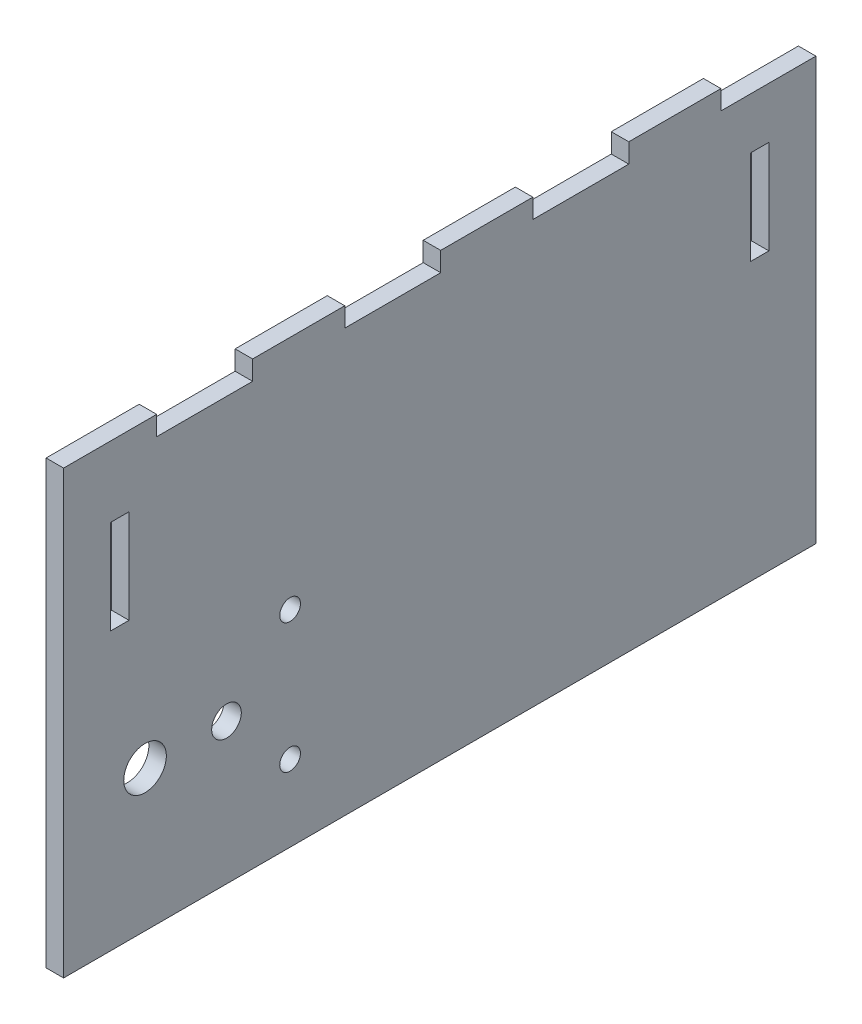
ISO-10303-21;
HEADER;
FILE_DESCRIPTION(('STEP AP214'),'2;1');
FILE_NAME('part.step','',(''),(''),'','','');
FILE_SCHEMA(('AUTOMOTIVE_DESIGN { 1 0 10303 214 1 1 1 1 }'));
ENDSEC;
DATA;
#1=APPLICATION_CONTEXT('core data for automotive mechanical design processes');
#2=APPLICATION_PROTOCOL_DEFINITION('international standard','automotive_design',2000,#1);
#3=PRODUCT_CONTEXT('',#1,'mechanical');
#4=PRODUCT('Part','Part','',(#3));
#5=PRODUCT_RELATED_PRODUCT_CATEGORY('part','',(#4));
#6=PRODUCT_DEFINITION_FORMATION('','',#4);
#7=PRODUCT_DEFINITION_CONTEXT('part definition',#1,'design');
#8=PRODUCT_DEFINITION('design','',#6,#7);
#9=PRODUCT_DEFINITION_SHAPE('','',#8);
#10=(LENGTH_UNIT() NAMED_UNIT(*) SI_UNIT(.MILLI.,.METRE.));
#11=(NAMED_UNIT(*) PLANE_ANGLE_UNIT() SI_UNIT($,.RADIAN.));
#12=(NAMED_UNIT(*) SI_UNIT($,.STERADIAN.) SOLID_ANGLE_UNIT());
#13=UNCERTAINTY_MEASURE_WITH_UNIT(LENGTH_MEASURE(1.E-05),#10,'distance_accuracy_value','');
#14=(GEOMETRIC_REPRESENTATION_CONTEXT(3) GLOBAL_UNCERTAINTY_ASSIGNED_CONTEXT((#13)) GLOBAL_UNIT_ASSIGNED_CONTEXT((#10,
#11,#12)) REPRESENTATION_CONTEXT('',''));
#15=CARTESIAN_POINT('',(0.,0.,0.));
#16=DIRECTION('',(0.,0.,1.));
#17=DIRECTION('',(1.,0.,0.));
#18=AXIS2_PLACEMENT_3D('',#15,#16,#17);
#19=CARTESIAN_POINT('',(2.3622,0.,-101.6));
#20=DIRECTION('',(0.,1.,0.));
#21=DIRECTION('',(0.,0.,1.));
#22=AXIS2_PLACEMENT_3D('',#19,#20,#21);
#23=PLANE('',#22);
#24=DIRECTION('',(0.,0.,-1.));
#25=VECTOR('',#24,1.);
#26=CARTESIAN_POINT('',(0.,0.,-101.6));
#27=LINE('',#26,#25);
#28=CARTESIAN_POINT('',(0.,0.,0.));
#29=VERTEX_POINT('',#28);
#30=CARTESIAN_POINT('',(0.,0.,-101.6));
#31=VERTEX_POINT('',#30);
#32=EDGE_CURVE('E394',#29,#31,#27,.T.);
#33=ORIENTED_EDGE('',*,*,#32,.T.);
#34=DIRECTION('',(-1.,0.,0.));
#35=VECTOR('',#34,1.);
#36=CARTESIAN_POINT('',(2.3622,0.,-101.6));
#37=LINE('',#36,#35);
#38=CARTESIAN_POINT('',(2.3622,0.,-101.6));
#39=VERTEX_POINT('',#38);
#40=EDGE_CURVE('E11',#39,#31,#37,.T.);
#41=ORIENTED_EDGE('',*,*,#40,.F.);
#42=DIRECTION('',(0.,0.,-1.));
#43=VECTOR('',#42,1.);
#44=CARTESIAN_POINT('',(2.3622,0.,-101.6));
#45=LINE('',#44,#43);
#46=CARTESIAN_POINT('',(2.3622,0.,0.));
#47=VERTEX_POINT('',#46);
#48=EDGE_CURVE('E397',#47,#39,#45,.T.);
#49=ORIENTED_EDGE('',*,*,#48,.F.);
#50=DIRECTION('',(-1.,0.,0.));
#51=VECTOR('',#50,1.);
#52=CARTESIAN_POINT('',(2.3622,0.,0.));
#53=LINE('',#52,#51);
#54=EDGE_CURVE('E414',#47,#29,#53,.T.);
#55=ORIENTED_EDGE('',*,*,#54,.T.);
#56=EDGE_LOOP('',(#33,#41,#49,#55));
#57=FACE_BOUND('',#56,.T.);
#58=ADVANCED_FACE('F33',(#57),#23,.F.);
#59=CARTESIAN_POINT('',(2.3622,57.15,-101.6));
#60=DIRECTION('',(0.,0.,1.));
#61=DIRECTION('',(0.,-1.,0.));
#62=AXIS2_PLACEMENT_3D('',#59,#60,#61);
#63=PLANE('',#62);
#64=DIRECTION('',(0.,1.,0.));
#65=VECTOR('',#64,1.);
#66=CARTESIAN_POINT('',(0.,57.15,-101.6));
#67=LINE('',#66,#65);
#68=CARTESIAN_POINT('',(0.,57.023,-101.6));
#69=VERTEX_POINT('',#68);
#70=EDGE_CURVE('E417',#31,#69,#67,.T.);
#71=ORIENTED_EDGE('',*,*,#70,.T.);
#72=DIRECTION('',(1.,0.,0.));
#73=VECTOR('',#72,1.);
#74=CARTESIAN_POINT('',(0.,57.023,-101.6));
#75=LINE('',#74,#73);
#76=CARTESIAN_POINT('',(2.3622,57.023,-101.6));
#77=VERTEX_POINT('',#76);
#78=EDGE_CURVE('E288',#69,#77,#75,.T.);
#79=ORIENTED_EDGE('',*,*,#78,.T.);
#80=DIRECTION('',(0.,1.,0.));
#81=VECTOR('',#80,1.);
#82=CARTESIAN_POINT('',(2.3622,57.15,-101.6));
#83=LINE('',#82,#81);
#84=EDGE_CURVE('E400',#39,#77,#83,.T.);
#85=ORIENTED_EDGE('',*,*,#84,.F.);
#86=ORIENTED_EDGE('',*,*,#40,.T.);
#87=EDGE_LOOP('',(#71,#79,#85,#86));
#88=FACE_BOUND('',#87,.T.);
#89=ADVANCED_FACE('F509',(#88),#63,.F.);
#90=CARTESIAN_POINT('',(2.3622,59.6392,-76.2));
#91=DIRECTION('',(0.,-1.,0.));
#92=DIRECTION('',(0.,0.,-1.));
#93=AXIS2_PLACEMENT_3D('',#90,#91,#92);
#94=PLANE('',#93);
#95=DIRECTION('',(0.,0.,1.));
#96=VECTOR('',#95,1.);
#97=CARTESIAN_POINT('',(2.3622,59.6392,-76.2));
#98=LINE('',#97,#96);
#99=CARTESIAN_POINT('',(2.3622,59.6392,-88.773));
#100=VERTEX_POINT('',#99);
#101=CARTESIAN_POINT('',(2.3622,59.6392,-76.327));
#102=VERTEX_POINT('',#101);
#103=EDGE_CURVE('E404',#100,#102,#98,.T.);
#104=ORIENTED_EDGE('',*,*,#103,.F.);
#105=DIRECTION('',(1.,0.,0.));
#106=VECTOR('',#105,1.);
#107=CARTESIAN_POINT('',(0.,59.6392,-88.773));
#108=LINE('',#107,#106);
#109=CARTESIAN_POINT('',(0.,59.6392,-88.773));
#110=VERTEX_POINT('',#109);
#111=EDGE_CURVE('E285',#110,#100,#108,.T.);
#112=ORIENTED_EDGE('',*,*,#111,.F.);
#113=DIRECTION('',(0.,0.,1.));
#114=VECTOR('',#113,1.);
#115=CARTESIAN_POINT('',(0.,59.6392,-76.2));
#116=LINE('',#115,#114);
#117=CARTESIAN_POINT('',(0.,59.6392,-76.327));
#118=VERTEX_POINT('',#117);
#119=EDGE_CURVE('E420',#110,#118,#116,.T.);
#120=ORIENTED_EDGE('',*,*,#119,.T.);
#121=DIRECTION('',(1.,0.,0.));
#122=VECTOR('',#121,1.);
#123=CARTESIAN_POINT('',(0.,59.6392,-76.327));
#124=LINE('',#123,#122);
#125=EDGE_CURVE('E315',#118,#102,#124,.T.);
#126=ORIENTED_EDGE('',*,*,#125,.T.);
#127=EDGE_LOOP('',(#104,#112,#120,#126));
#128=FACE_BOUND('',#127,.T.);
#129=ADVANCED_FACE('F500',(#128),#94,.F.);
#130=CARTESIAN_POINT('',(2.3622,59.6392,-50.8));
#131=DIRECTION('',(0.,-1.,0.));
#132=DIRECTION('',(0.,0.,-1.));
#133=AXIS2_PLACEMENT_3D('',#130,#131,#132);
#134=PLANE('',#133);
#135=DIRECTION('',(0.,0.,1.));
#136=VECTOR('',#135,1.);
#137=CARTESIAN_POINT('',(2.3622,59.6392,-50.8));
#138=LINE('',#137,#136);
#139=CARTESIAN_POINT('',(2.3622,59.6392,-63.373));
#140=VERTEX_POINT('',#139);
#141=CARTESIAN_POINT('',(2.3622,59.6392,-50.927));
#142=VERTEX_POINT('',#141);
#143=EDGE_CURVE('E406',#140,#142,#138,.T.);
#144=ORIENTED_EDGE('',*,*,#143,.F.);
#145=DIRECTION('',(1.,0.,0.));
#146=VECTOR('',#145,1.);
#147=CARTESIAN_POINT('',(0.,59.6392,-63.373));
#148=LINE('',#147,#146);
#149=CARTESIAN_POINT('',(0.,59.6392,-63.373));
#150=VERTEX_POINT('',#149);
#151=EDGE_CURVE('E313',#150,#140,#148,.T.);
#152=ORIENTED_EDGE('',*,*,#151,.F.);
#153=DIRECTION('',(0.,0.,1.));
#154=VECTOR('',#153,1.);
#155=CARTESIAN_POINT('',(0.,59.6392,-50.8));
#156=LINE('',#155,#154);
#157=CARTESIAN_POINT('',(0.,59.6392,-50.927));
#158=VERTEX_POINT('',#157);
#159=EDGE_CURVE('E422',#150,#158,#156,.T.);
#160=ORIENTED_EDGE('',*,*,#159,.T.);
#161=DIRECTION('',(1.,0.,0.));
#162=VECTOR('',#161,1.);
#163=CARTESIAN_POINT('',(0.,59.6392,-50.927));
#164=LINE('',#163,#162);
#165=EDGE_CURVE('E342',#158,#142,#164,.T.);
#166=ORIENTED_EDGE('',*,*,#165,.T.);
#167=EDGE_LOOP('',(#144,#152,#160,#166));
#168=FACE_BOUND('',#167,.T.);
#169=ADVANCED_FACE('F484',(#168),#134,.F.);
#170=CARTESIAN_POINT('',(2.3622,59.6392,-25.4));
#171=DIRECTION('',(0.,-1.,0.));
#172=DIRECTION('',(0.,0.,-1.));
#173=AXIS2_PLACEMENT_3D('',#170,#171,#172);
#174=PLANE('',#173);
#175=DIRECTION('',(0.,0.,1.));
#176=VECTOR('',#175,1.);
#177=CARTESIAN_POINT('',(2.3622,59.6392,-25.4));
#178=LINE('',#177,#176);
#179=CARTESIAN_POINT('',(2.3622,59.6392,-37.973));
#180=VERTEX_POINT('',#179);
#181=CARTESIAN_POINT('',(2.3622,59.6392,-25.527));
#182=VERTEX_POINT('',#181);
#183=EDGE_CURVE('E408',#180,#182,#178,.T.);
#184=ORIENTED_EDGE('',*,*,#183,.F.);
#185=DIRECTION('',(1.,0.,0.));
#186=VECTOR('',#185,1.);
#187=CARTESIAN_POINT('',(0.,59.6392,-37.973));
#188=LINE('',#187,#186);
#189=CARTESIAN_POINT('',(0.,59.6392,-37.973));
#190=VERTEX_POINT('',#189);
#191=EDGE_CURVE('E340',#190,#180,#188,.T.);
#192=ORIENTED_EDGE('',*,*,#191,.F.);
#193=DIRECTION('',(0.,0.,1.));
#194=VECTOR('',#193,1.);
#195=CARTESIAN_POINT('',(0.,59.6392,-25.4));
#196=LINE('',#195,#194);
#197=CARTESIAN_POINT('',(0.,59.6392,-25.527));
#198=VERTEX_POINT('',#197);
#199=EDGE_CURVE('E424',#190,#198,#196,.T.);
#200=ORIENTED_EDGE('',*,*,#199,.T.);
#201=DIRECTION('',(1.,0.,0.));
#202=VECTOR('',#201,1.);
#203=CARTESIAN_POINT('',(0.,59.6392,-25.527));
#204=LINE('',#203,#202);
#205=EDGE_CURVE('E369',#198,#182,#204,.T.);
#206=ORIENTED_EDGE('',*,*,#205,.T.);
#207=EDGE_LOOP('',(#184,#192,#200,#206));
#208=FACE_BOUND('',#207,.T.);
#209=ADVANCED_FACE('F466',(#208),#174,.F.);
#210=CARTESIAN_POINT('',(2.3622,59.6392,0.));
#211=DIRECTION('',(0.,-1.,0.));
#212=DIRECTION('',(0.,0.,-1.));
#213=AXIS2_PLACEMENT_3D('',#210,#211,#212);
#214=PLANE('',#213);
#215=DIRECTION('',(0.,0.,1.));
#216=VECTOR('',#215,1.);
#217=CARTESIAN_POINT('',(2.3622,59.6392,0.));
#218=LINE('',#217,#216);
#219=CARTESIAN_POINT('',(2.3622,59.6392,-12.573));
#220=VERTEX_POINT('',#219);
#221=CARTESIAN_POINT('',(2.3622,59.6392,0.));
#222=VERTEX_POINT('',#221);
#223=EDGE_CURVE('E410',#220,#222,#218,.T.);
#224=ORIENTED_EDGE('',*,*,#223,.F.);
#225=DIRECTION('',(1.,0.,0.));
#226=VECTOR('',#225,1.);
#227=CARTESIAN_POINT('',(0.,59.6392,-12.573));
#228=LINE('',#227,#226);
#229=CARTESIAN_POINT('',(0.,59.6392,-12.573));
#230=VERTEX_POINT('',#229);
#231=EDGE_CURVE('E367',#230,#220,#228,.T.);
#232=ORIENTED_EDGE('',*,*,#231,.F.);
#233=DIRECTION('',(0.,0.,1.));
#234=VECTOR('',#233,1.);
#235=CARTESIAN_POINT('',(0.,59.6392,0.));
#236=LINE('',#235,#234);
#237=CARTESIAN_POINT('',(0.,59.6392,0.));
#238=VERTEX_POINT('',#237);
#239=EDGE_CURVE('E426',#230,#238,#236,.T.);
#240=ORIENTED_EDGE('',*,*,#239,.T.);
#241=DIRECTION('',(-1.,0.,0.));
#242=VECTOR('',#241,1.);
#243=CARTESIAN_POINT('',(2.3622,59.6392,0.));
#244=LINE('',#243,#242);
#245=EDGE_CURVE('E40',#222,#238,#244,.T.);
#246=ORIENTED_EDGE('',*,*,#245,.F.);
#247=EDGE_LOOP('',(#224,#232,#240,#246));
#248=FACE_BOUND('',#247,.T.);
#249=ADVANCED_FACE('F452',(#248),#214,.F.);
#250=CARTESIAN_POINT('',(2.3622,0.,0.));
#251=DIRECTION('',(0.,0.,-1.));
#252=DIRECTION('',(-1.,0.,0.));
#253=AXIS2_PLACEMENT_3D('',#250,#251,#252);
#254=PLANE('',#253);
#255=DIRECTION('',(0.,-1.,0.));
#256=VECTOR('',#255,1.);
#257=CARTESIAN_POINT('',(0.,0.,0.));
#258=LINE('',#257,#256);
#259=EDGE_CURVE('E401',#238,#29,#258,.T.);
#260=ORIENTED_EDGE('',*,*,#259,.T.);
#261=ORIENTED_EDGE('',*,*,#54,.F.);
#262=DIRECTION('',(0.,-1.,0.));
#263=VECTOR('',#262,1.);
#264=CARTESIAN_POINT('',(2.3622,0.,0.));
#265=LINE('',#264,#263);
#266=EDGE_CURVE('E412',#222,#47,#265,.T.);
#267=ORIENTED_EDGE('',*,*,#266,.F.);
#268=ORIENTED_EDGE('',*,*,#245,.T.);
#269=EDGE_LOOP('',(#260,#261,#267,#268));
#270=FACE_BOUND('',#269,.T.);
#271=ADVANCED_FACE('F435',(#270),#254,.F.);
#272=CARTESIAN_POINT('',(2.3622,0.,0.));
#273=DIRECTION('',(-1.,0.,0.));
#274=DIRECTION('',(0.,0.,1.));
#275=AXIS2_PLACEMENT_3D('',#272,#273,#274);
#276=PLANE('',#275);
#277=DIRECTION('',(0.,-1.,0.));
#278=VECTOR('',#277,1.);
#279=CARTESIAN_POINT('',(2.3622,50.1142,-92.7608));
#280=LINE('',#279,#278);
#281=CARTESIAN_POINT('',(2.3622,50.1142,-92.7608));
#282=VERTEX_POINT('',#281);
#283=CARTESIAN_POINT('',(2.3622,37.4142,-92.7608));
#284=VERTEX_POINT('',#283);
#285=EDGE_CURVE('E232',#282,#284,#280,.T.);
#286=ORIENTED_EDGE('',*,*,#285,.F.);
#287=DIRECTION('',(0.,0.,1.));
#288=VECTOR('',#287,1.);
#289=CARTESIAN_POINT('',(2.3622,50.1142,-95.25));
#290=LINE('',#289,#288);
#291=CARTESIAN_POINT('',(2.3622,50.1142,-95.25));
#292=VERTEX_POINT('',#291);
#293=EDGE_CURVE('E47',#292,#282,#290,.T.);
#294=ORIENTED_EDGE('',*,*,#293,.F.);
#295=DIRECTION('',(0.,1.,0.));
#296=VECTOR('',#295,1.);
#297=CARTESIAN_POINT('',(2.3622,50.1142,-95.25));
#298=LINE('',#297,#296);
#299=CARTESIAN_POINT('',(2.3622,37.4142,-95.25));
#300=VERTEX_POINT('',#299);
#301=EDGE_CURVE('E223',#300,#292,#298,.T.);
#302=ORIENTED_EDGE('',*,*,#301,.F.);
#303=DIRECTION('',(0.,0.,-1.));
#304=VECTOR('',#303,1.);
#305=CARTESIAN_POINT('',(2.3622,37.4142,-95.25));
#306=LINE('',#305,#304);
#307=EDGE_CURVE('E226',#284,#300,#306,.T.);
#308=ORIENTED_EDGE('',*,*,#307,.F.);
#309=EDGE_LOOP('',(#286,#294,#302,#308));
#310=FACE_BOUND('',#309,.T.);
#311=DIRECTION('',(0.,0.,-1.));
#312=VECTOR('',#311,1.);
#313=CARTESIAN_POINT('',(2.3622,37.4142,-6.35));
#314=LINE('',#313,#312);
#315=CARTESIAN_POINT('',(2.3622,37.4142,-6.35));
#316=VERTEX_POINT('',#315);
#317=CARTESIAN_POINT('',(2.3622,37.4142,-8.8392));
#318=VERTEX_POINT('',#317);
#319=EDGE_CURVE('E257',#316,#318,#314,.T.);
#320=ORIENTED_EDGE('',*,*,#319,.F.);
#321=DIRECTION('',(0.,-1.,0.));
#322=VECTOR('',#321,1.);
#323=CARTESIAN_POINT('',(2.3622,50.1142,-6.35));
#324=LINE('',#323,#322);
#325=CARTESIAN_POINT('',(2.3622,50.1142,-6.35));
#326=VERTEX_POINT('',#325);
#327=EDGE_CURVE('E238',#326,#316,#324,.T.);
#328=ORIENTED_EDGE('',*,*,#327,.F.);
#329=DIRECTION('',(0.,0.,1.));
#330=VECTOR('',#329,1.);
#331=CARTESIAN_POINT('',(2.3622,50.1142,-6.35));
#332=LINE('',#331,#330);
#333=CARTESIAN_POINT('',(2.3622,50.1142,-8.8392));
#334=VERTEX_POINT('',#333);
#335=EDGE_CURVE('E246',#334,#326,#332,.T.);
#336=ORIENTED_EDGE('',*,*,#335,.F.);
#337=DIRECTION('',(0.,1.,0.));
#338=VECTOR('',#337,1.);
#339=CARTESIAN_POINT('',(2.3622,50.1142,-8.8392));
#340=LINE('',#339,#338);
#341=EDGE_CURVE('E260',#318,#334,#340,.T.);
#342=ORIENTED_EDGE('',*,*,#341,.F.);
#343=EDGE_LOOP('',(#320,#328,#336,#342));
#344=FACE_BOUND('',#343,.T.);
#345=CARTESIAN_POINT('',(2.3622,19.05,-11.));
#346=DIRECTION('',(1.,0.,0.));
#347=DIRECTION('',(0.,0.,1.));
#348=AXIS2_PLACEMENT_3D('',#345,#346,#347);
#349=CIRCLE('',#348,2.87699996099999);
#350=CARTESIAN_POINT('',(2.3622,19.05,-8.12300003899999));
#351=VERTEX_POINT('',#350);
#352=EDGE_CURVE('E373',#351,#351,#349,.T.);
#353=ORIENTED_EDGE('',*,*,#352,.F.);
#354=EDGE_LOOP('',(#353));
#355=FACE_BOUND('',#354,.T.);
#356=CARTESIAN_POINT('',(2.3622,19.05,-22.0000034));
#357=DIRECTION('',(1.,0.,0.));
#358=DIRECTION('',(0.,0.,1.));
#359=AXIS2_PLACEMENT_3D('',#356,#357,#358);
#360=CIRCLE('',#359,1.99999999999998);
#361=CARTESIAN_POINT('',(2.3622,19.05,-20.0000034));
#362=VERTEX_POINT('',#361);
#363=EDGE_CURVE('E379',#362,#362,#360,.T.);
#364=ORIENTED_EDGE('',*,*,#363,.F.);
#365=EDGE_LOOP('',(#364));
#366=FACE_BOUND('',#365,.T.);
#367=CARTESIAN_POINT('',(2.3622,27.8,-30.59102));
#368=DIRECTION('',(1.,0.,0.));
#369=DIRECTION('',(0.,0.,1.));
#370=AXIS2_PLACEMENT_3D('',#367,#368,#369);
#371=CIRCLE('',#370,1.39999999999999);
#372=CARTESIAN_POINT('',(2.3622,27.8,-29.19102));
#373=VERTEX_POINT('',#372);
#374=EDGE_CURVE('E385',#373,#373,#371,.T.);
#375=ORIENTED_EDGE('',*,*,#374,.F.);
#376=EDGE_LOOP('',(#375));
#377=FACE_BOUND('',#376,.T.);
#378=CARTESIAN_POINT('',(2.3622,10.3,-30.59102));
#379=DIRECTION('',(1.,0.,0.));
#380=DIRECTION('',(0.,0.,1.));
#381=AXIS2_PLACEMENT_3D('',#378,#379,#380);
#382=CIRCLE('',#381,1.39999999999999);
#383=CARTESIAN_POINT('',(2.3622,10.3,-29.19102));
#384=VERTEX_POINT('',#383);
#385=EDGE_CURVE('E391',#384,#384,#382,.T.);
#386=ORIENTED_EDGE('',*,*,#385,.F.);
#387=EDGE_LOOP('',(#386));
#388=FACE_BOUND('',#387,.T.);
#389=DIRECTION('',(0.,0.,-1.));
#390=VECTOR('',#389,1.);
#391=CARTESIAN_POINT('',(2.3622,57.0230000000001,0.));
#392=LINE('',#391,#390);
#393=CARTESIAN_POINT('',(2.3622,57.023,-88.773));
#394=VERTEX_POINT('',#393);
#395=EDGE_CURVE('E278',#394,#77,#392,.T.);
#396=ORIENTED_EDGE('',*,*,#395,.F.);
#397=DIRECTION('',(0.,-1.,0.));
#398=VECTOR('',#397,1.);
#399=CARTESIAN_POINT('',(2.3622,0.,-88.773));
#400=LINE('',#399,#398);
#401=EDGE_CURVE('E267',#100,#394,#400,.T.);
#402=ORIENTED_EDGE('',*,*,#401,.F.);
#403=ORIENTED_EDGE('',*,*,#103,.T.);
#404=DIRECTION('',(0.,1.,0.));
#405=VECTOR('',#404,1.);
#406=CARTESIAN_POINT('',(2.3622,0.,-76.327));
#407=LINE('',#406,#405);
#408=CARTESIAN_POINT('',(2.3622,57.023,-76.327));
#409=VERTEX_POINT('',#408);
#410=EDGE_CURVE('E305',#409,#102,#407,.T.);
#411=ORIENTED_EDGE('',*,*,#410,.F.);
#412=DIRECTION('',(0.,0.,-1.));
#413=VECTOR('',#412,1.);
#414=CARTESIAN_POINT('',(2.3622,57.023,0.));
#415=LINE('',#414,#413);
#416=CARTESIAN_POINT('',(2.3622,57.023,-63.373));
#417=VERTEX_POINT('',#416);
#418=EDGE_CURVE('E287',#417,#409,#415,.T.);
#419=ORIENTED_EDGE('',*,*,#418,.F.);
#420=DIRECTION('',(0.,-1.,0.));
#421=VECTOR('',#420,1.);
#422=CARTESIAN_POINT('',(2.3622,0.,-63.373));
#423=LINE('',#422,#421);
#424=EDGE_CURVE('E296',#140,#417,#423,.T.);
#425=ORIENTED_EDGE('',*,*,#424,.F.);
#426=ORIENTED_EDGE('',*,*,#143,.T.);
#427=DIRECTION('',(0.,1.,0.));
#428=VECTOR('',#427,1.);
#429=CARTESIAN_POINT('',(2.3622,0.,-50.927));
#430=LINE('',#429,#428);
#431=CARTESIAN_POINT('',(2.3622,57.023,-50.927));
#432=VERTEX_POINT('',#431);
#433=EDGE_CURVE('E332',#432,#142,#430,.T.);
#434=ORIENTED_EDGE('',*,*,#433,.F.);
#435=DIRECTION('',(0.,0.,-1.));
#436=VECTOR('',#435,1.);
#437=CARTESIAN_POINT('',(2.3622,57.023,0.));
#438=LINE('',#437,#436);
#439=CARTESIAN_POINT('',(2.3622,57.023,-37.973));
#440=VERTEX_POINT('',#439);
#441=EDGE_CURVE('E312',#440,#432,#438,.T.);
#442=ORIENTED_EDGE('',*,*,#441,.F.);
#443=DIRECTION('',(0.,-1.,0.));
#444=VECTOR('',#443,1.);
#445=CARTESIAN_POINT('',(2.3622,0.,-37.973));
#446=LINE('',#445,#444);
#447=EDGE_CURVE('E323',#180,#440,#446,.T.);
#448=ORIENTED_EDGE('',*,*,#447,.F.);
#449=ORIENTED_EDGE('',*,*,#183,.T.);
#450=DIRECTION('',(0.,1.,0.));
#451=VECTOR('',#450,1.);
#452=CARTESIAN_POINT('',(2.3622,0.,-25.527));
#453=LINE('',#452,#451);
#454=CARTESIAN_POINT('',(2.3622,57.023,-25.527));
#455=VERTEX_POINT('',#454);
#456=EDGE_CURVE('E359',#455,#182,#453,.T.);
#457=ORIENTED_EDGE('',*,*,#456,.F.);
#458=DIRECTION('',(0.,0.,-1.));
#459=VECTOR('',#458,1.);
#460=CARTESIAN_POINT('',(2.3622,57.023,0.));
#461=LINE('',#460,#459);
#462=CARTESIAN_POINT('',(2.3622,57.023,-12.573));
#463=VERTEX_POINT('',#462);
#464=EDGE_CURVE('E339',#463,#455,#461,.T.);
#465=ORIENTED_EDGE('',*,*,#464,.F.);
#466=DIRECTION('',(0.,-1.,0.));
#467=VECTOR('',#466,1.);
#468=CARTESIAN_POINT('',(2.3622,0.,-12.573));
#469=LINE('',#468,#467);
#470=EDGE_CURVE('E350',#220,#463,#469,.T.);
#471=ORIENTED_EDGE('',*,*,#470,.F.);
#472=ORIENTED_EDGE('',*,*,#223,.T.);
#473=ORIENTED_EDGE('',*,*,#266,.T.);
#474=ORIENTED_EDGE('',*,*,#48,.T.);
#475=ORIENTED_EDGE('',*,*,#84,.T.);
#476=EDGE_LOOP('',(#396,#402,#403,#411,#419,#425,#426,#434,#442,#448,#449,#457,#465,#471,#472,
#473,#474,#475));
#477=FACE_BOUND('',#476,.T.);
#478=ADVANCED_FACE('F448',(#310,#344,#355,#366,#377,#388,#477),#276,.F.);
#479=CARTESIAN_POINT('',(0.,0.,0.));
#480=DIRECTION('',(-1.,0.,0.));
#481=DIRECTION('',(0.,0.,1.));
#482=AXIS2_PLACEMENT_3D('',#479,#480,#481);
#483=PLANE('',#482);
#484=DIRECTION('',(0.,0.,1.));
#485=VECTOR('',#484,1.);
#486=CARTESIAN_POINT('',(0.,50.1142,-95.25));
#487=LINE('',#486,#485);
#488=CARTESIAN_POINT('',(0.,50.1142,-95.25));
#489=VERTEX_POINT('',#488);
#490=CARTESIAN_POINT('',(0.,50.1142,-92.7608));
#491=VERTEX_POINT('',#490);
#492=EDGE_CURVE('E207',#489,#491,#487,.T.);
#493=ORIENTED_EDGE('',*,*,#492,.T.);
#494=DIRECTION('',(0.,-1.,0.));
#495=VECTOR('',#494,1.);
#496=CARTESIAN_POINT('',(0.,50.1142,-92.7608));
#497=LINE('',#496,#495);
#498=CARTESIAN_POINT('',(0.,37.4142,-92.7608));
#499=VERTEX_POINT('',#498);
#500=EDGE_CURVE('E216',#491,#499,#497,.T.);
#501=ORIENTED_EDGE('',*,*,#500,.T.);
#502=DIRECTION('',(0.,0.,-1.));
#503=VECTOR('',#502,1.);
#504=CARTESIAN_POINT('',(0.,37.4142,-95.25));
#505=LINE('',#504,#503);
#506=CARTESIAN_POINT('',(0.,37.4142,-95.25));
#507=VERTEX_POINT('',#506);
#508=EDGE_CURVE('E55',#499,#507,#505,.T.);
#509=ORIENTED_EDGE('',*,*,#508,.T.);
#510=DIRECTION('',(0.,1.,0.));
#511=VECTOR('',#510,1.);
#512=CARTESIAN_POINT('',(0.,50.1142,-95.25));
#513=LINE('',#512,#511);
#514=EDGE_CURVE('E213',#507,#489,#513,.T.);
#515=ORIENTED_EDGE('',*,*,#514,.T.);
#516=EDGE_LOOP('',(#493,#501,#509,#515));
#517=FACE_BOUND('',#516,.T.);
#518=DIRECTION('',(0.,-1.,0.));
#519=VECTOR('',#518,1.);
#520=CARTESIAN_POINT('',(0.,50.1142,-6.35));
#521=LINE('',#520,#519);
#522=CARTESIAN_POINT('',(0.,50.1142,-6.35));
#523=VERTEX_POINT('',#522);
#524=CARTESIAN_POINT('',(0.,37.4142,-6.35));
#525=VERTEX_POINT('',#524);
#526=EDGE_CURVE('E242',#523,#525,#521,.T.);
#527=ORIENTED_EDGE('',*,*,#526,.T.);
#528=DIRECTION('',(0.,0.,-1.));
#529=VECTOR('',#528,1.);
#530=CARTESIAN_POINT('',(0.,37.4142,-6.35));
#531=LINE('',#530,#529);
#532=CARTESIAN_POINT('',(0.,37.4142,-8.8392));
#533=VERTEX_POINT('',#532);
#534=EDGE_CURVE('E245',#525,#533,#531,.T.);
#535=ORIENTED_EDGE('',*,*,#534,.T.);
#536=DIRECTION('',(0.,1.,0.));
#537=VECTOR('',#536,1.);
#538=CARTESIAN_POINT('',(0.,50.1142,-8.8392));
#539=LINE('',#538,#537);
#540=CARTESIAN_POINT('',(0.,50.1142,-8.8392));
#541=VERTEX_POINT('',#540);
#542=EDGE_CURVE('E249',#533,#541,#539,.T.);
#543=ORIENTED_EDGE('',*,*,#542,.T.);
#544=DIRECTION('',(0.,0.,1.));
#545=VECTOR('',#544,1.);
#546=CARTESIAN_POINT('',(0.,50.1142,-6.35));
#547=LINE('',#546,#545);
#548=EDGE_CURVE('E252',#541,#523,#547,.T.);
#549=ORIENTED_EDGE('',*,*,#548,.T.);
#550=EDGE_LOOP('',(#527,#535,#543,#549));
#551=FACE_BOUND('',#550,.T.);
#552=DIRECTION('',(0.,-1.,0.));
#553=VECTOR('',#552,1.);
#554=CARTESIAN_POINT('',(0.,0.,-88.773));
#555=LINE('',#554,#553);
#556=CARTESIAN_POINT('',(0.,57.023,-88.773));
#557=VERTEX_POINT('',#556);
#558=EDGE_CURVE('E274',#110,#557,#555,.T.);
#559=ORIENTED_EDGE('',*,*,#558,.T.);
#560=DIRECTION('',(0.,0.,-1.));
#561=VECTOR('',#560,1.);
#562=CARTESIAN_POINT('',(0.,57.0230000000001,0.));
#563=LINE('',#562,#561);
#564=EDGE_CURVE('E277',#557,#69,#563,.T.);
#565=ORIENTED_EDGE('',*,*,#564,.T.);
#566=ORIENTED_EDGE('',*,*,#70,.F.);
#567=ORIENTED_EDGE('',*,*,#32,.F.);
#568=ORIENTED_EDGE('',*,*,#259,.F.);
#569=ORIENTED_EDGE('',*,*,#239,.F.);
#570=DIRECTION('',(0.,-1.,0.));
#571=VECTOR('',#570,1.);
#572=CARTESIAN_POINT('',(0.,0.,-12.573));
#573=LINE('',#572,#571);
#574=CARTESIAN_POINT('',(0.,57.023,-12.573));
#575=VERTEX_POINT('',#574);
#576=EDGE_CURVE('E353',#230,#575,#573,.T.);
#577=ORIENTED_EDGE('',*,*,#576,.T.);
#578=DIRECTION('',(0.,0.,-1.));
#579=VECTOR('',#578,1.);
#580=CARTESIAN_POINT('',(0.,57.023,0.));
#581=LINE('',#580,#579);
#582=CARTESIAN_POINT('',(0.,57.023,-25.527));
#583=VERTEX_POINT('',#582);
#584=EDGE_CURVE('E346',#575,#583,#581,.T.);
#585=ORIENTED_EDGE('',*,*,#584,.T.);
#586=DIRECTION('',(0.,1.,0.));
#587=VECTOR('',#586,1.);
#588=CARTESIAN_POINT('',(0.,0.,-25.527));
#589=LINE('',#588,#587);
#590=EDGE_CURVE('E349',#583,#198,#589,.T.);
#591=ORIENTED_EDGE('',*,*,#590,.T.);
#592=ORIENTED_EDGE('',*,*,#199,.F.);
#593=DIRECTION('',(0.,-1.,0.));
#594=VECTOR('',#593,1.);
#595=CARTESIAN_POINT('',(0.,0.,-37.973));
#596=LINE('',#595,#594);
#597=CARTESIAN_POINT('',(0.,57.023,-37.973));
#598=VERTEX_POINT('',#597);
#599=EDGE_CURVE('E326',#190,#598,#596,.T.);
#600=ORIENTED_EDGE('',*,*,#599,.T.);
#601=DIRECTION('',(0.,0.,-1.));
#602=VECTOR('',#601,1.);
#603=CARTESIAN_POINT('',(0.,57.023,0.));
#604=LINE('',#603,#602);
#605=CARTESIAN_POINT('',(0.,57.023,-50.927));
#606=VERTEX_POINT('',#605);
#607=EDGE_CURVE('E319',#598,#606,#604,.T.);
#608=ORIENTED_EDGE('',*,*,#607,.T.);
#609=DIRECTION('',(0.,1.,0.));
#610=VECTOR('',#609,1.);
#611=CARTESIAN_POINT('',(0.,0.,-50.927));
#612=LINE('',#611,#610);
#613=EDGE_CURVE('E322',#606,#158,#612,.T.);
#614=ORIENTED_EDGE('',*,*,#613,.T.);
#615=ORIENTED_EDGE('',*,*,#159,.F.);
#616=DIRECTION('',(0.,-1.,0.));
#617=VECTOR('',#616,1.);
#618=CARTESIAN_POINT('',(0.,0.,-63.373));
#619=LINE('',#618,#617);
#620=CARTESIAN_POINT('',(0.,57.023,-63.373));
#621=VERTEX_POINT('',#620);
#622=EDGE_CURVE('E299',#150,#621,#619,.T.);
#623=ORIENTED_EDGE('',*,*,#622,.T.);
#624=DIRECTION('',(0.,0.,-1.));
#625=VECTOR('',#624,1.);
#626=CARTESIAN_POINT('',(0.,57.023,0.));
#627=LINE('',#626,#625);
#628=CARTESIAN_POINT('',(0.,57.023,-76.327));
#629=VERTEX_POINT('',#628);
#630=EDGE_CURVE('E292',#621,#629,#627,.T.);
#631=ORIENTED_EDGE('',*,*,#630,.T.);
#632=DIRECTION('',(0.,1.,0.));
#633=VECTOR('',#632,1.);
#634=CARTESIAN_POINT('',(0.,0.,-76.327));
#635=LINE('',#634,#633);
#636=EDGE_CURVE('E295',#629,#118,#635,.T.);
#637=ORIENTED_EDGE('',*,*,#636,.T.);
#638=ORIENTED_EDGE('',*,*,#119,.F.);
#639=EDGE_LOOP('',(#559,#565,#566,#567,#568,#569,#577,#585,#591,#592,#600,#608,#614,#615,#623,
#631,#637,#638));
#640=FACE_BOUND('',#639,.T.);
#641=CARTESIAN_POINT('',(0.,19.05,-11.));
#642=DIRECTION('',(-1.,0.,0.));
#643=DIRECTION('',(0.,0.,1.));
#644=AXIS2_PLACEMENT_3D('',#641,#642,#643);
#645=CIRCLE('',#644,2.87699996099999);
#646=CARTESIAN_POINT('',(0.,19.05,-8.12300003899999));
#647=VERTEX_POINT('',#646);
#648=EDGE_CURVE('E366',#647,#647,#645,.F.);
#649=ORIENTED_EDGE('',*,*,#648,.T.);
#650=EDGE_LOOP('',(#649));
#651=FACE_BOUND('',#650,.T.);
#652=CARTESIAN_POINT('',(0.,19.05,-22.0000034));
#653=DIRECTION('',(-1.,0.,0.));
#654=DIRECTION('',(0.,0.,1.));
#655=AXIS2_PLACEMENT_3D('',#652,#653,#654);
#656=CIRCLE('',#655,1.99999999999998);
#657=CARTESIAN_POINT('',(0.,19.05,-20.0000034));
#658=VERTEX_POINT('',#657);
#659=EDGE_CURVE('E376',#658,#658,#656,.F.);
#660=ORIENTED_EDGE('',*,*,#659,.T.);
#661=EDGE_LOOP('',(#660));
#662=FACE_BOUND('',#661,.T.);
#663=CARTESIAN_POINT('',(0.,27.8,-30.59102));
#664=DIRECTION('',(-1.,0.,0.));
#665=DIRECTION('',(0.,0.,1.));
#666=AXIS2_PLACEMENT_3D('',#663,#664,#665);
#667=CIRCLE('',#666,1.39999999999999);
#668=CARTESIAN_POINT('',(0.,27.8,-29.19102));
#669=VERTEX_POINT('',#668);
#670=EDGE_CURVE('E382',#669,#669,#667,.F.);
#671=ORIENTED_EDGE('',*,*,#670,.T.);
#672=EDGE_LOOP('',(#671));
#673=FACE_BOUND('',#672,.T.);
#674=CARTESIAN_POINT('',(0.,10.3,-30.59102));
#675=DIRECTION('',(-1.,0.,0.));
#676=DIRECTION('',(0.,0.,1.));
#677=AXIS2_PLACEMENT_3D('',#674,#675,#676);
#678=CIRCLE('',#677,1.39999999999999);
#679=CARTESIAN_POINT('',(0.,10.3,-29.19102));
#680=VERTEX_POINT('',#679);
#681=EDGE_CURVE('E388',#680,#680,#678,.F.);
#682=ORIENTED_EDGE('',*,*,#681,.T.);
#683=EDGE_LOOP('',(#682));
#684=FACE_BOUND('',#683,.T.);
#685=ADVANCED_FACE('F220',(#517,#551,#640,#651,#662,#673,#684),#483,.T.);
#686=CARTESIAN_POINT('',(-0.00100000000000013,10.3,-30.59102));
#687=DIRECTION('',(1.,0.,0.));
#688=DIRECTION('',(0.,0.,-1.));
#689=AXIS2_PLACEMENT_3D('',#686,#687,#688);
#690=CYLINDRICAL_SURFACE('',#689,1.39999999999999);
#691=ORIENTED_EDGE('',*,*,#681,.F.);
#692=EDGE_LOOP('',(#691));
#693=FACE_BOUND('',#692,.T.);
#694=ORIENTED_EDGE('',*,*,#385,.T.);
#695=EDGE_LOOP('',(#694));
#696=FACE_BOUND('',#695,.T.);
#697=ADVANCED_FACE('F527',(#693,#696),#690,.F.);
#698=CARTESIAN_POINT('',(-0.00100000000000013,27.8,-30.59102));
#699=DIRECTION('',(1.,0.,0.));
#700=DIRECTION('',(0.,0.,-1.));
#701=AXIS2_PLACEMENT_3D('',#698,#699,#700);
#702=CYLINDRICAL_SURFACE('',#701,1.39999999999999);
#703=ORIENTED_EDGE('',*,*,#670,.F.);
#704=EDGE_LOOP('',(#703));
#705=FACE_BOUND('',#704,.T.);
#706=ORIENTED_EDGE('',*,*,#374,.T.);
#707=EDGE_LOOP('',(#706));
#708=FACE_BOUND('',#707,.T.);
#709=ADVANCED_FACE('F533',(#705,#708),#702,.F.);
#710=CARTESIAN_POINT('',(-0.00100000000000013,19.05,-22.0000034));
#711=DIRECTION('',(1.,0.,0.));
#712=DIRECTION('',(0.,0.,-1.));
#713=AXIS2_PLACEMENT_3D('',#710,#711,#712);
#714=CYLINDRICAL_SURFACE('',#713,1.99999999999998);
#715=ORIENTED_EDGE('',*,*,#659,.F.);
#716=EDGE_LOOP('',(#715));
#717=FACE_BOUND('',#716,.T.);
#718=ORIENTED_EDGE('',*,*,#363,.T.);
#719=EDGE_LOOP('',(#718));
#720=FACE_BOUND('',#719,.T.);
#721=ADVANCED_FACE('F537',(#717,#720),#714,.F.);
#722=CARTESIAN_POINT('',(-0.00100000000000013,19.05,-11.));
#723=DIRECTION('',(1.,0.,0.));
#724=DIRECTION('',(0.,0.,-1.));
#725=AXIS2_PLACEMENT_3D('',#722,#723,#724);
#726=CYLINDRICAL_SURFACE('',#725,2.87699996099999);
#727=ORIENTED_EDGE('',*,*,#648,.F.);
#728=EDGE_LOOP('',(#727));
#729=FACE_BOUND('',#728,.T.);
#730=ORIENTED_EDGE('',*,*,#352,.T.);
#731=EDGE_LOOP('',(#730));
#732=FACE_BOUND('',#731,.T.);
#733=ADVANCED_FACE('F541',(#729,#732),#726,.F.);
#734=CARTESIAN_POINT('',(0.,57.023,0.));
#735=DIRECTION('',(0.,-1.,0.));
#736=DIRECTION('',(0.,0.,-1.));
#737=AXIS2_PLACEMENT_3D('',#734,#735,#736);
#738=PLANE('',#737);
#739=ORIENTED_EDGE('',*,*,#464,.T.);
#740=DIRECTION('',(1.,0.,0.));
#741=VECTOR('',#740,1.);
#742=CARTESIAN_POINT('',(0.,57.023,-25.527));
#743=LINE('',#742,#741);
#744=EDGE_CURVE('E356',#583,#455,#743,.T.);
#745=ORIENTED_EDGE('',*,*,#744,.F.);
#746=ORIENTED_EDGE('',*,*,#584,.F.);
#747=DIRECTION('',(1.,0.,0.));
#748=VECTOR('',#747,1.);
#749=CARTESIAN_POINT('',(0.,57.023,-12.573));
#750=LINE('',#749,#748);
#751=EDGE_CURVE('E364',#575,#463,#750,.T.);
#752=ORIENTED_EDGE('',*,*,#751,.T.);
#753=EDGE_LOOP('',(#739,#745,#746,#752));
#754=FACE_BOUND('',#753,.T.);
#755=ADVANCED_FACE('F459',(#754),#738,.F.);
#756=CARTESIAN_POINT('',(0.,0.,-12.573));
#757=DIRECTION('',(0.,0.,1.));
#758=DIRECTION('',(1.,0.,0.));
#759=AXIS2_PLACEMENT_3D('',#756,#757,#758);
#760=PLANE('',#759);
#761=ORIENTED_EDGE('',*,*,#470,.T.);
#762=ORIENTED_EDGE('',*,*,#751,.F.);
#763=ORIENTED_EDGE('',*,*,#576,.F.);
#764=ORIENTED_EDGE('',*,*,#231,.T.);
#765=EDGE_LOOP('',(#761,#762,#763,#764));
#766=FACE_BOUND('',#765,.T.);
#767=ADVANCED_FACE('F454',(#766),#760,.F.);
#768=CARTESIAN_POINT('',(0.,0.,-25.527));
#769=DIRECTION('',(0.,0.,-1.));
#770=DIRECTION('',(-1.,0.,0.));
#771=AXIS2_PLACEMENT_3D('',#768,#769,#770);
#772=PLANE('',#771);
#773=ORIENTED_EDGE('',*,*,#456,.T.);
#774=ORIENTED_EDGE('',*,*,#205,.F.);
#775=ORIENTED_EDGE('',*,*,#590,.F.);
#776=ORIENTED_EDGE('',*,*,#744,.T.);
#777=EDGE_LOOP('',(#773,#774,#775,#776));
#778=FACE_BOUND('',#777,.T.);
#779=ADVANCED_FACE('F463',(#778),#772,.F.);
#780=CARTESIAN_POINT('',(0.,57.023,0.));
#781=DIRECTION('',(0.,-1.,0.));
#782=DIRECTION('',(0.,0.,-1.));
#783=AXIS2_PLACEMENT_3D('',#780,#781,#782);
#784=PLANE('',#783);
#785=ORIENTED_EDGE('',*,*,#441,.T.);
#786=DIRECTION('',(1.,0.,0.));
#787=VECTOR('',#786,1.);
#788=CARTESIAN_POINT('',(0.,57.023,-50.927));
#789=LINE('',#788,#787);
#790=EDGE_CURVE('E329',#606,#432,#789,.T.);
#791=ORIENTED_EDGE('',*,*,#790,.F.);
#792=ORIENTED_EDGE('',*,*,#607,.F.);
#793=DIRECTION('',(1.,0.,0.));
#794=VECTOR('',#793,1.);
#795=CARTESIAN_POINT('',(0.,57.023,-37.973));
#796=LINE('',#795,#794);
#797=EDGE_CURVE('E337',#598,#440,#796,.T.);
#798=ORIENTED_EDGE('',*,*,#797,.T.);
#799=EDGE_LOOP('',(#785,#791,#792,#798));
#800=FACE_BOUND('',#799,.T.);
#801=ADVANCED_FACE('F474',(#800),#784,.F.);
#802=CARTESIAN_POINT('',(0.,0.,-37.973));
#803=DIRECTION('',(0.,0.,1.));
#804=DIRECTION('',(1.,0.,0.));
#805=AXIS2_PLACEMENT_3D('',#802,#803,#804);
#806=PLANE('',#805);
#807=ORIENTED_EDGE('',*,*,#447,.T.);
#808=ORIENTED_EDGE('',*,*,#797,.F.);
#809=ORIENTED_EDGE('',*,*,#599,.F.);
#810=ORIENTED_EDGE('',*,*,#191,.T.);
#811=EDGE_LOOP('',(#807,#808,#809,#810));
#812=FACE_BOUND('',#811,.T.);
#813=ADVANCED_FACE('F470',(#812),#806,.F.);
#814=CARTESIAN_POINT('',(0.,0.,-50.927));
#815=DIRECTION('',(0.,0.,-1.));
#816=DIRECTION('',(-1.,0.,0.));
#817=AXIS2_PLACEMENT_3D('',#814,#815,#816);
#818=PLANE('',#817);
#819=ORIENTED_EDGE('',*,*,#433,.T.);
#820=ORIENTED_EDGE('',*,*,#165,.F.);
#821=ORIENTED_EDGE('',*,*,#613,.F.);
#822=ORIENTED_EDGE('',*,*,#790,.T.);
#823=EDGE_LOOP('',(#819,#820,#821,#822));
#824=FACE_BOUND('',#823,.T.);
#825=ADVANCED_FACE('F479',(#824),#818,.F.);
#826=CARTESIAN_POINT('',(0.,57.023,0.));
#827=DIRECTION('',(0.,-1.,0.));
#828=DIRECTION('',(0.,0.,-1.));
#829=AXIS2_PLACEMENT_3D('',#826,#827,#828);
#830=PLANE('',#829);
#831=ORIENTED_EDGE('',*,*,#418,.T.);
#832=DIRECTION('',(1.,0.,0.));
#833=VECTOR('',#832,1.);
#834=CARTESIAN_POINT('',(0.,57.023,-76.327));
#835=LINE('',#834,#833);
#836=EDGE_CURVE('E302',#629,#409,#835,.T.);
#837=ORIENTED_EDGE('',*,*,#836,.F.);
#838=ORIENTED_EDGE('',*,*,#630,.F.);
#839=DIRECTION('',(1.,0.,0.));
#840=VECTOR('',#839,1.);
#841=CARTESIAN_POINT('',(0.,57.023,-63.373));
#842=LINE('',#841,#840);
#843=EDGE_CURVE('E310',#621,#417,#842,.T.);
#844=ORIENTED_EDGE('',*,*,#843,.T.);
#845=EDGE_LOOP('',(#831,#837,#838,#844));
#846=FACE_BOUND('',#845,.T.);
#847=ADVANCED_FACE('F491',(#846),#830,.F.);
#848=CARTESIAN_POINT('',(0.,0.,-63.373));
#849=DIRECTION('',(0.,0.,1.));
#850=DIRECTION('',(1.,0.,0.));
#851=AXIS2_PLACEMENT_3D('',#848,#849,#850);
#852=PLANE('',#851);
#853=ORIENTED_EDGE('',*,*,#424,.T.);
#854=ORIENTED_EDGE('',*,*,#843,.F.);
#855=ORIENTED_EDGE('',*,*,#622,.F.);
#856=ORIENTED_EDGE('',*,*,#151,.T.);
#857=EDGE_LOOP('',(#853,#854,#855,#856));
#858=FACE_BOUND('',#857,.T.);
#859=ADVANCED_FACE('F487',(#858),#852,.F.);
#860=CARTESIAN_POINT('',(0.,0.,-76.327));
#861=DIRECTION('',(0.,0.,-1.));
#862=DIRECTION('',(-1.,0.,0.));
#863=AXIS2_PLACEMENT_3D('',#860,#861,#862);
#864=PLANE('',#863);
#865=ORIENTED_EDGE('',*,*,#410,.T.);
#866=ORIENTED_EDGE('',*,*,#125,.F.);
#867=ORIENTED_EDGE('',*,*,#636,.F.);
#868=ORIENTED_EDGE('',*,*,#836,.T.);
#869=EDGE_LOOP('',(#865,#866,#867,#868));
#870=FACE_BOUND('',#869,.T.);
#871=ADVANCED_FACE('F497',(#870),#864,.F.);
#872=CARTESIAN_POINT('',(0.,0.,-88.773));
#873=DIRECTION('',(0.,0.,1.));
#874=DIRECTION('',(1.,0.,0.));
#875=AXIS2_PLACEMENT_3D('',#872,#873,#874);
#876=PLANE('',#875);
#877=ORIENTED_EDGE('',*,*,#401,.T.);
#878=DIRECTION('',(1.,0.,0.));
#879=VECTOR('',#878,1.);
#880=CARTESIAN_POINT('',(0.,57.023,-88.773));
#881=LINE('',#880,#879);
#882=EDGE_CURVE('E281',#557,#394,#881,.T.);
#883=ORIENTED_EDGE('',*,*,#882,.F.);
#884=ORIENTED_EDGE('',*,*,#558,.F.);
#885=ORIENTED_EDGE('',*,*,#111,.T.);
#886=EDGE_LOOP('',(#877,#883,#884,#885));
#887=FACE_BOUND('',#886,.T.);
#888=ADVANCED_FACE('F504',(#887),#876,.F.);
#889=CARTESIAN_POINT('',(0.,57.0230000000001,0.));
#890=DIRECTION('',(0.,-1.,0.));
#891=DIRECTION('',(0.,0.,-1.));
#892=AXIS2_PLACEMENT_3D('',#889,#890,#891);
#893=PLANE('',#892);
#894=ORIENTED_EDGE('',*,*,#395,.T.);
#895=ORIENTED_EDGE('',*,*,#78,.F.);
#896=ORIENTED_EDGE('',*,*,#564,.F.);
#897=ORIENTED_EDGE('',*,*,#882,.T.);
#898=EDGE_LOOP('',(#894,#895,#896,#897));
#899=FACE_BOUND('',#898,.T.);
#900=ADVANCED_FACE('F506',(#899),#893,.F.);
#901=CARTESIAN_POINT('',(0.,50.1142,-6.35));
#902=DIRECTION('',(0.,0.,1.));
#903=DIRECTION('',(0.,-1.,0.));
#904=AXIS2_PLACEMENT_3D('',#901,#902,#903);
#905=PLANE('',#904);
#906=ORIENTED_EDGE('',*,*,#327,.T.);
#907=DIRECTION('',(1.,0.,0.));
#908=VECTOR('',#907,1.);
#909=CARTESIAN_POINT('',(0.,37.4142,-6.35));
#910=LINE('',#909,#908);
#911=EDGE_CURVE('E255',#525,#316,#910,.T.);
#912=ORIENTED_EDGE('',*,*,#911,.F.);
#913=ORIENTED_EDGE('',*,*,#526,.F.);
#914=DIRECTION('',(1.,0.,0.));
#915=VECTOR('',#914,1.);
#916=CARTESIAN_POINT('',(0.,50.1142,-6.35));
#917=LINE('',#916,#915);
#918=EDGE_CURVE('E265',#523,#326,#917,.T.);
#919=ORIENTED_EDGE('',*,*,#918,.T.);
#920=EDGE_LOOP('',(#906,#912,#913,#919));
#921=FACE_BOUND('',#920,.T.);
#922=ADVANCED_FACE('F568',(#921),#905,.F.);
#923=CARTESIAN_POINT('',(0.,50.1142,-6.35));
#924=DIRECTION('',(0.,1.,0.));
#925=DIRECTION('',(0.,0.,1.));
#926=AXIS2_PLACEMENT_3D('',#923,#924,#925);
#927=PLANE('',#926);
#928=ORIENTED_EDGE('',*,*,#335,.T.);
#929=ORIENTED_EDGE('',*,*,#918,.F.);
#930=ORIENTED_EDGE('',*,*,#548,.F.);
#931=DIRECTION('',(1.,0.,0.));
#932=VECTOR('',#931,1.);
#933=CARTESIAN_POINT('',(0.,50.1142,-8.8392));
#934=LINE('',#933,#932);
#935=EDGE_CURVE('E268',#541,#334,#934,.T.);
#936=ORIENTED_EDGE('',*,*,#935,.T.);
#937=EDGE_LOOP('',(#928,#929,#930,#936));
#938=FACE_BOUND('',#937,.T.);
#939=ADVANCED_FACE('F571',(#938),#927,.F.);
#940=CARTESIAN_POINT('',(0.,50.1142,-8.8392));
#941=DIRECTION('',(0.,0.,-1.));
#942=DIRECTION('',(0.,1.,0.));
#943=AXIS2_PLACEMENT_3D('',#940,#941,#942);
#944=PLANE('',#943);
#945=ORIENTED_EDGE('',*,*,#341,.T.);
#946=ORIENTED_EDGE('',*,*,#935,.F.);
#947=ORIENTED_EDGE('',*,*,#542,.F.);
#948=DIRECTION('',(1.,0.,0.));
#949=VECTOR('',#948,1.);
#950=CARTESIAN_POINT('',(0.,37.4142,-8.8392));
#951=LINE('',#950,#949);
#952=EDGE_CURVE('E270',#533,#318,#951,.T.);
#953=ORIENTED_EDGE('',*,*,#952,.T.);
#954=EDGE_LOOP('',(#945,#946,#947,#953));
#955=FACE_BOUND('',#954,.T.);
#956=ADVANCED_FACE('F576',(#955),#944,.F.);
#957=CARTESIAN_POINT('',(0.,37.4142,-6.35));
#958=DIRECTION('',(0.,-1.,0.));
#959=DIRECTION('',(0.,0.,-1.));
#960=AXIS2_PLACEMENT_3D('',#957,#958,#959);
#961=PLANE('',#960);
#962=ORIENTED_EDGE('',*,*,#319,.T.);
#963=ORIENTED_EDGE('',*,*,#952,.F.);
#964=ORIENTED_EDGE('',*,*,#534,.F.);
#965=ORIENTED_EDGE('',*,*,#911,.T.);
#966=EDGE_LOOP('',(#962,#963,#964,#965));
#967=FACE_BOUND('',#966,.T.);
#968=ADVANCED_FACE('F573',(#967),#961,.F.);
#969=CARTESIAN_POINT('',(0.,50.1142,-95.25));
#970=DIRECTION('',(0.,1.,0.));
#971=DIRECTION('',(0.,0.,1.));
#972=AXIS2_PLACEMENT_3D('',#969,#970,#971);
#973=PLANE('',#972);
#974=ORIENTED_EDGE('',*,*,#293,.T.);
#975=DIRECTION('',(1.,0.,0.));
#976=VECTOR('',#975,1.);
#977=CARTESIAN_POINT('',(0.,50.1142,-92.7608));
#978=LINE('',#977,#976);
#979=EDGE_CURVE('E203',#491,#282,#978,.T.);
#980=ORIENTED_EDGE('',*,*,#979,.F.);
#981=ORIENTED_EDGE('',*,*,#492,.F.);
#982=DIRECTION('',(1.,0.,0.));
#983=VECTOR('',#982,1.);
#984=CARTESIAN_POINT('',(0.,50.1142,-95.25));
#985=LINE('',#984,#983);
#986=EDGE_CURVE('E236',#489,#292,#985,.T.);
#987=ORIENTED_EDGE('',*,*,#986,.T.);
#988=EDGE_LOOP('',(#974,#980,#981,#987));
#989=FACE_BOUND('',#988,.T.);
#990=ADVANCED_FACE('F205',(#989),#973,.F.);
#991=CARTESIAN_POINT('',(0.,50.1142,-95.25));
#992=DIRECTION('',(0.,0.,-1.));
#993=DIRECTION('',(-1.,0.,0.));
#994=AXIS2_PLACEMENT_3D('',#991,#992,#993);
#995=PLANE('',#994);
#996=ORIENTED_EDGE('',*,*,#301,.T.);
#997=ORIENTED_EDGE('',*,*,#986,.F.);
#998=ORIENTED_EDGE('',*,*,#514,.F.);
#999=DIRECTION('',(1.,0.,0.));
#1000=VECTOR('',#999,1.);
#1001=CARTESIAN_POINT('',(0.,37.4142,-95.25));
#1002=LINE('',#1001,#1000);
#1003=EDGE_CURVE('E239',#507,#300,#1002,.T.);
#1004=ORIENTED_EDGE('',*,*,#1003,.T.);
#1005=EDGE_LOOP('',(#996,#997,#998,#1004));
#1006=FACE_BOUND('',#1005,.T.);
#1007=ADVANCED_FACE('F586',(#1006),#995,.F.);
#1008=CARTESIAN_POINT('',(0.,37.4142,-95.25));
#1009=DIRECTION('',(0.,-1.,0.));
#1010=DIRECTION('',(0.,0.,-1.));
#1011=AXIS2_PLACEMENT_3D('',#1008,#1009,#1010);
#1012=PLANE('',#1011);
#1013=ORIENTED_EDGE('',*,*,#307,.T.);
#1014=ORIENTED_EDGE('',*,*,#1003,.F.);
#1015=ORIENTED_EDGE('',*,*,#508,.F.);
#1016=DIRECTION('',(1.,0.,0.));
#1017=VECTOR('',#1016,1.);
#1018=CARTESIAN_POINT('',(0.,37.4142,-92.7608));
#1019=LINE('',#1018,#1017);
#1020=EDGE_CURVE('E212',#499,#284,#1019,.T.);
#1021=ORIENTED_EDGE('',*,*,#1020,.T.);
#1022=EDGE_LOOP('',(#1013,#1014,#1015,#1021));
#1023=FACE_BOUND('',#1022,.T.);
#1024=ADVANCED_FACE('F589',(#1023),#1012,.F.);
#1025=CARTESIAN_POINT('',(0.,50.1142,-92.7608));
#1026=DIRECTION('',(0.,0.,1.));
#1027=DIRECTION('',(1.,0.,0.));
#1028=AXIS2_PLACEMENT_3D('',#1025,#1026,#1027);
#1029=PLANE('',#1028);
#1030=ORIENTED_EDGE('',*,*,#285,.T.);
#1031=ORIENTED_EDGE('',*,*,#1020,.F.);
#1032=ORIENTED_EDGE('',*,*,#500,.F.);
#1033=ORIENTED_EDGE('',*,*,#979,.T.);
#1034=EDGE_LOOP('',(#1030,#1031,#1032,#1033));
#1035=FACE_BOUND('',#1034,.T.);
#1036=ADVANCED_FACE('F217',(#1035),#1029,.F.);
#1037=CLOSED_SHELL('',(#58,#89,#129,#169,#209,#249,#271,#478,#685,#697,#709,#721,#733,#755,#767,
#779,#801,#813,#825,#847,#859,#871,#888,#900,#922,#939,#956,#968,#990,#1007,#1024,#1036));
#1038=MANIFOLD_SOLID_BREP('B2',#1037);
#1039=ADVANCED_BREP_SHAPE_REPRESENTATION('',(#18,#1038),#14);
#1040=SHAPE_DEFINITION_REPRESENTATION(#9,#1039);
ENDSEC;
END-ISO-10303-21;
